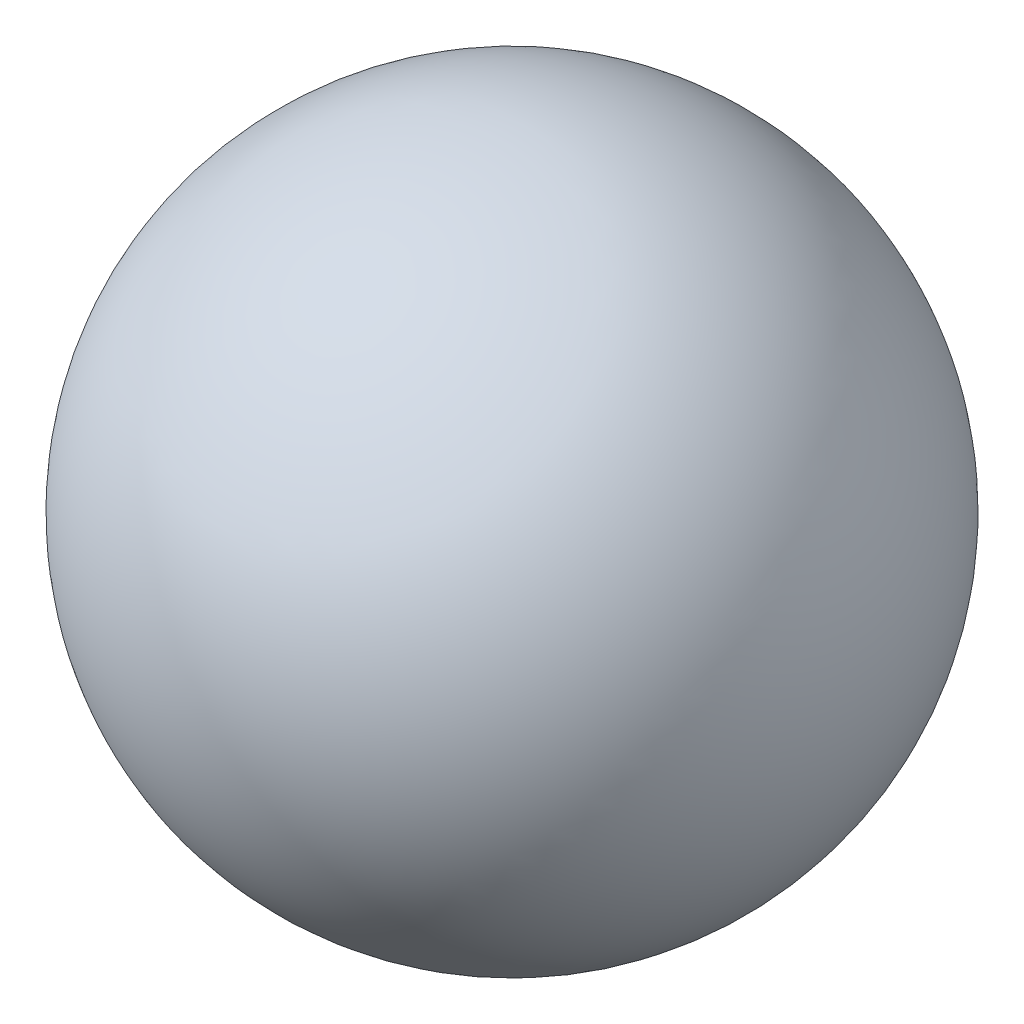
ISO-10303-21;
HEADER;
FILE_DESCRIPTION(('STEP AP214'),'2;1');
FILE_NAME('part.step','',(''),(''),'','','');
FILE_SCHEMA(('AUTOMOTIVE_DESIGN { 1 0 10303 214 1 1 1 1 }'));
ENDSEC;
DATA;
#1=APPLICATION_CONTEXT('core data for automotive mechanical design processes');
#2=APPLICATION_PROTOCOL_DEFINITION('international standard','automotive_design',2000,#1);
#3=PRODUCT_CONTEXT('',#1,'mechanical');
#4=PRODUCT('Part','Part','',(#3));
#5=PRODUCT_RELATED_PRODUCT_CATEGORY('part','',(#4));
#6=PRODUCT_DEFINITION_FORMATION('','',#4);
#7=PRODUCT_DEFINITION_CONTEXT('part definition',#1,'design');
#8=PRODUCT_DEFINITION('design','',#6,#7);
#9=PRODUCT_DEFINITION_SHAPE('','',#8);
#10=(LENGTH_UNIT() NAMED_UNIT(*) SI_UNIT(.MILLI.,.METRE.));
#11=(NAMED_UNIT(*) PLANE_ANGLE_UNIT() SI_UNIT($,.RADIAN.));
#12=(NAMED_UNIT(*) SI_UNIT($,.STERADIAN.) SOLID_ANGLE_UNIT());
#13=UNCERTAINTY_MEASURE_WITH_UNIT(LENGTH_MEASURE(1.E-05),#10,'distance_accuracy_value','');
#14=(GEOMETRIC_REPRESENTATION_CONTEXT(3) GLOBAL_UNCERTAINTY_ASSIGNED_CONTEXT((#13)) GLOBAL_UNIT_ASSIGNED_CONTEXT((#10,
#11,#12)) REPRESENTATION_CONTEXT('',''));
#15=CARTESIAN_POINT('',(0.,0.,0.));
#16=DIRECTION('',(0.,0.,1.));
#17=DIRECTION('',(1.,0.,0.));
#18=AXIS2_PLACEMENT_3D('',#15,#16,#17);
#19=CARTESIAN_POINT('',(4.3251265396448,-3.,6.73002826264944));
#20=DIRECTION('',(0.,0.,1.));
#21=DIRECTION('',(1.,0.,0.));
#22=AXIS2_PLACEMENT_3D('',#19,#20,#21);
#23=SPHERICAL_SURFACE('',#22,1.8);
#24=CARTESIAN_POINT('',(4.3251265396448,-3.,8.53002826264944));
#25=VERTEX_POINT('',#24);
#26=VERTEX_LOOP('',#25);
#27=FACE_BOUND('',#26,.T.);
#28=ADVANCED_FACE('F12',(#27),#23,.T.);
#29=CLOSED_SHELL('',(#28));
#30=MANIFOLD_SOLID_BREP('B1',#29);
#31=ADVANCED_BREP_SHAPE_REPRESENTATION('',(#18,#30),#14);
#32=SHAPE_DEFINITION_REPRESENTATION(#9,#31);
ENDSEC;
END-ISO-10303-21;
